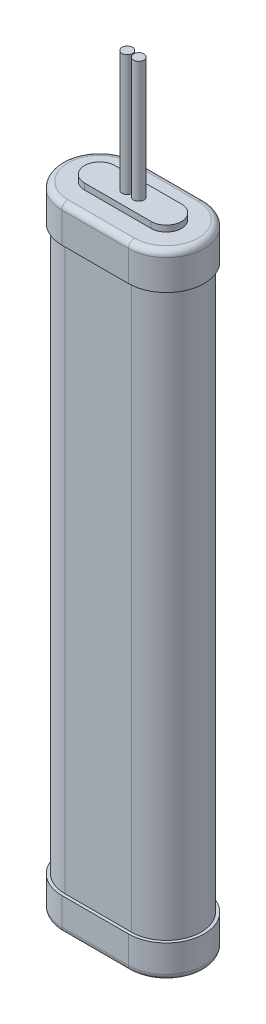
ISO-10303-21;
HEADER;
FILE_DESCRIPTION(('STEP AP214'),'2;1');
FILE_NAME('part.step','',(''),(''),'','','');
FILE_SCHEMA(('AUTOMOTIVE_DESIGN { 1 0 10303 214 1 1 1 1 }'));
ENDSEC;
DATA;
#1=APPLICATION_CONTEXT('core data for automotive mechanical design processes');
#2=APPLICATION_PROTOCOL_DEFINITION('international standard','automotive_design',2000,#1);
#3=PRODUCT_CONTEXT('',#1,'mechanical');
#4=PRODUCT('Part','Part','',(#3));
#5=PRODUCT_RELATED_PRODUCT_CATEGORY('part','',(#4));
#6=PRODUCT_DEFINITION_FORMATION('','',#4);
#7=PRODUCT_DEFINITION_CONTEXT('part definition',#1,'design');
#8=PRODUCT_DEFINITION('design','',#6,#7);
#9=PRODUCT_DEFINITION_SHAPE('','',#8);
#10=(LENGTH_UNIT() NAMED_UNIT(*) SI_UNIT(.MILLI.,.METRE.));
#11=(NAMED_UNIT(*) PLANE_ANGLE_UNIT() SI_UNIT($,.RADIAN.));
#12=(NAMED_UNIT(*) SI_UNIT($,.STERADIAN.) SOLID_ANGLE_UNIT());
#13=UNCERTAINTY_MEASURE_WITH_UNIT(LENGTH_MEASURE(1.E-05),#10,'distance_accuracy_value','');
#14=(GEOMETRIC_REPRESENTATION_CONTEXT(3) GLOBAL_UNCERTAINTY_ASSIGNED_CONTEXT((#13)) GLOBAL_UNIT_ASSIGNED_CONTEXT((#10,
#11,#12)) REPRESENTATION_CONTEXT('',''));
#15=CARTESIAN_POINT('',(0.,0.,0.));
#16=DIRECTION('',(0.,0.,1.));
#17=DIRECTION('',(1.,0.,0.));
#18=AXIS2_PLACEMENT_3D('',#15,#16,#17);
#19=CARTESIAN_POINT('',(0.,211.,-12.5));
#20=DIRECTION('',(0.,1.,0.));
#21=DIRECTION('',(0.,0.,1.));
#22=AXIS2_PLACEMENT_3D('',#19,#20,#21);
#23=PLANE('',#22);
#24=CARTESIAN_POINT('',(9.1,211.,-12.5));
#25=DIRECTION('',(0.,1.,0.));
#26=DIRECTION('',(0.,0.,1.));
#27=AXIS2_PLACEMENT_3D('',#24,#25,#26);
#28=CIRCLE('',#27,1.75);
#29=CARTESIAN_POINT('',(9.1,211.,-10.75));
#30=VERTEX_POINT('',#29);
#31=EDGE_CURVE('E373',#30,#30,#28,.T.);
#32=ORIENTED_EDGE('',*,*,#31,.F.);
#33=EDGE_LOOP('',(#32));
#34=FACE_BOUND('',#33,.T.);
#35=CARTESIAN_POINT('',(0.,211.,-12.5));
#36=DIRECTION('',(0.,1.,0.));
#37=DIRECTION('',(0.,0.,1.));
#38=AXIS2_PLACEMENT_3D('',#35,#36,#37);
#39=CIRCLE('',#38,5.);
#40=CARTESIAN_POINT('',(0.,211.,-17.5));
#41=VERTEX_POINT('',#40);
#42=CARTESIAN_POINT('',(0.,211.,-7.5));
#43=VERTEX_POINT('',#42);
#44=EDGE_CURVE('E178',#41,#43,#39,.T.);
#45=ORIENTED_EDGE('',*,*,#44,.T.);
#46=DIRECTION('',(1.,0.,0.));
#47=VECTOR('',#46,1.);
#48=CARTESIAN_POINT('',(0.,211.,-7.5));
#49=LINE('',#48,#47);
#50=CARTESIAN_POINT('',(22.,211.,-7.5));
#51=VERTEX_POINT('',#50);
#52=EDGE_CURVE('E167',#43,#51,#49,.T.);
#53=ORIENTED_EDGE('',*,*,#52,.T.);
#54=CARTESIAN_POINT('',(22.,211.,-12.5));
#55=DIRECTION('',(0.,1.,0.));
#56=DIRECTION('',(0.,0.,-1.));
#57=AXIS2_PLACEMENT_3D('',#54,#55,#56);
#58=CIRCLE('',#57,5.);
#59=CARTESIAN_POINT('',(22.,211.,-17.5));
#60=VERTEX_POINT('',#59);
#61=EDGE_CURVE('E177',#51,#60,#58,.T.);
#62=ORIENTED_EDGE('',*,*,#61,.T.);
#63=DIRECTION('',(-1.,0.,0.));
#64=VECTOR('',#63,1.);
#65=CARTESIAN_POINT('',(0.,211.,-17.5));
#66=LINE('',#65,#64);
#67=EDGE_CURVE('E183',#60,#41,#66,.T.);
#68=ORIENTED_EDGE('',*,*,#67,.T.);
#69=EDGE_LOOP('',(#45,#53,#62,#68));
#70=FACE_BOUND('',#69,.T.);
#71=CARTESIAN_POINT('',(12.9,211.,-12.5));
#72=DIRECTION('',(0.,1.,0.));
#73=DIRECTION('',(0.,0.,-1.));
#74=AXIS2_PLACEMENT_3D('',#71,#72,#73);
#75=CIRCLE('',#74,1.75);
#76=CARTESIAN_POINT('',(12.9,211.,-14.25));
#77=VERTEX_POINT('',#76);
#78=EDGE_CURVE('E379',#77,#77,#75,.T.);
#79=ORIENTED_EDGE('',*,*,#78,.F.);
#80=EDGE_LOOP('',(#79));
#81=FACE_BOUND('',#80,.T.);
#82=ADVANCED_FACE('F30',(#34,#70,#81),#23,.T.);
#83=CARTESIAN_POINT('',(0.,209.,-12.5));
#84=DIRECTION('',(0.,1.,0.));
#85=DIRECTION('',(0.,0.,1.));
#86=AXIS2_PLACEMENT_3D('',#83,#84,#85);
#87=PLANE('',#86);
#88=DIRECTION('',(1.,0.,0.));
#89=VECTOR('',#88,1.);
#90=CARTESIAN_POINT('',(22.,209.,-2.));
#91=LINE('',#90,#89);
#92=CARTESIAN_POINT('',(0.,209.,-2.));
#93=VERTEX_POINT('',#92);
#94=CARTESIAN_POINT('',(22.,209.,-2.));
#95=VERTEX_POINT('',#94);
#96=EDGE_CURVE('E297',#93,#95,#91,.T.);
#97=ORIENTED_EDGE('',*,*,#96,.T.);
#98=CARTESIAN_POINT('',(22.,209.,-12.5));
#99=DIRECTION('',(0.,1.,0.));
#100=DIRECTION('',(0.,0.,1.));
#101=AXIS2_PLACEMENT_3D('',#98,#99,#100);
#102=CIRCLE('',#101,10.5);
#103=CARTESIAN_POINT('',(22.,209.,-23.));
#104=VERTEX_POINT('',#103);
#105=EDGE_CURVE('E299',#95,#104,#102,.T.);
#106=ORIENTED_EDGE('',*,*,#105,.T.);
#107=DIRECTION('',(-1.,0.,0.));
#108=VECTOR('',#107,1.);
#109=CARTESIAN_POINT('',(0.,209.,-23.));
#110=LINE('',#109,#108);
#111=CARTESIAN_POINT('',(0.,209.,-23.));
#112=VERTEX_POINT('',#111);
#113=EDGE_CURVE('E295',#104,#112,#110,.T.);
#114=ORIENTED_EDGE('',*,*,#113,.T.);
#115=CARTESIAN_POINT('',(0.,209.,-12.5));
#116=DIRECTION('',(0.,1.,0.));
#117=DIRECTION('',(0.,0.,1.));
#118=AXIS2_PLACEMENT_3D('',#115,#116,#117);
#119=CIRCLE('',#118,10.5);
#120=EDGE_CURVE('E293',#112,#93,#119,.T.);
#121=ORIENTED_EDGE('',*,*,#120,.T.);
#122=EDGE_LOOP('',(#97,#106,#114,#121));
#123=FACE_BOUND('',#122,.T.);
#124=DIRECTION('',(1.,0.,0.));
#125=VECTOR('',#124,1.);
#126=CARTESIAN_POINT('',(0.,209.,-7.5));
#127=LINE('',#126,#125);
#128=CARTESIAN_POINT('',(0.,209.,-7.5));
#129=VERTEX_POINT('',#128);
#130=CARTESIAN_POINT('',(22.,209.,-7.5));
#131=VERTEX_POINT('',#130);
#132=EDGE_CURVE('E355',#129,#131,#127,.T.);
#133=ORIENTED_EDGE('',*,*,#132,.F.);
#134=CARTESIAN_POINT('',(0.,209.,-12.5));
#135=DIRECTION('',(0.,1.,0.));
#136=DIRECTION('',(0.,0.,1.));
#137=AXIS2_PLACEMENT_3D('',#134,#135,#136);
#138=CIRCLE('',#137,5.);
#139=CARTESIAN_POINT('',(0.,209.,-17.5));
#140=VERTEX_POINT('',#139);
#141=EDGE_CURVE('E191',#140,#129,#138,.T.);
#142=ORIENTED_EDGE('',*,*,#141,.F.);
#143=DIRECTION('',(-1.,0.,0.));
#144=VECTOR('',#143,1.);
#145=CARTESIAN_POINT('',(0.,209.,-17.5));
#146=LINE('',#145,#144);
#147=CARTESIAN_POINT('',(22.,209.,-17.5));
#148=VERTEX_POINT('',#147);
#149=EDGE_CURVE('E187',#148,#140,#146,.T.);
#150=ORIENTED_EDGE('',*,*,#149,.F.);
#151=CARTESIAN_POINT('',(22.,209.,-12.5));
#152=DIRECTION('',(0.,1.,0.));
#153=DIRECTION('',(0.,0.,-1.));
#154=AXIS2_PLACEMENT_3D('',#151,#152,#153);
#155=CIRCLE('',#154,5.);
#156=EDGE_CURVE('E358',#131,#148,#155,.T.);
#157=ORIENTED_EDGE('',*,*,#156,.F.);
#158=EDGE_LOOP('',(#133,#142,#150,#157));
#159=FACE_BOUND('',#158,.T.);
#160=ADVANCED_FACE('F349',(#123,#159),#87,.T.);
#161=CARTESIAN_POINT('',(0.,11.,-12.5));
#162=DIRECTION('',(0.,-1.,0.));
#163=DIRECTION('',(0.,0.,-1.));
#164=AXIS2_PLACEMENT_3D('',#161,#162,#163);
#165=PLANE('',#164);
#166=CARTESIAN_POINT('',(0.,11.,-12.5));
#167=DIRECTION('',(0.,1.,0.));
#168=DIRECTION('',(0.,0.,-1.));
#169=AXIS2_PLACEMENT_3D('',#166,#167,#168);
#170=CIRCLE('',#169,12.5);
#171=CARTESIAN_POINT('',(0.,11.,-25.));
#172=VERTEX_POINT('',#171);
#173=CARTESIAN_POINT('',(0.,11.,0.));
#174=VERTEX_POINT('',#173);
#175=EDGE_CURVE('E254',#172,#174,#170,.T.);
#176=ORIENTED_EDGE('',*,*,#175,.T.);
#177=DIRECTION('',(1.,0.,0.));
#178=VECTOR('',#177,1.);
#179=CARTESIAN_POINT('',(0.,11.,0.));
#180=LINE('',#179,#178);
#181=CARTESIAN_POINT('',(22.,11.,0.));
#182=VERTEX_POINT('',#181);
#183=EDGE_CURVE('E257',#174,#182,#180,.T.);
#184=ORIENTED_EDGE('',*,*,#183,.T.);
#185=CARTESIAN_POINT('',(22.,11.,-12.5));
#186=DIRECTION('',(0.,1.,0.));
#187=DIRECTION('',(0.,0.,1.));
#188=AXIS2_PLACEMENT_3D('',#185,#186,#187);
#189=CIRCLE('',#188,12.5);
#190=CARTESIAN_POINT('',(22.,11.,-25.));
#191=VERTEX_POINT('',#190);
#192=EDGE_CURVE('E259',#182,#191,#189,.T.);
#193=ORIENTED_EDGE('',*,*,#192,.T.);
#194=DIRECTION('',(-1.,0.,0.));
#195=VECTOR('',#194,1.);
#196=CARTESIAN_POINT('',(0.,11.,-25.));
#197=LINE('',#196,#195);
#198=EDGE_CURVE('E261',#191,#172,#197,.T.);
#199=ORIENTED_EDGE('',*,*,#198,.T.);
#200=EDGE_LOOP('',(#176,#184,#193,#199));
#201=FACE_BOUND('',#200,.T.);
#202=CARTESIAN_POINT('',(0.,11.,-12.5));
#203=DIRECTION('',(0.,1.,0.));
#204=DIRECTION('',(0.,0.,-1.));
#205=AXIS2_PLACEMENT_3D('',#202,#203,#204);
#206=CIRCLE('',#205,11.5);
#207=CARTESIAN_POINT('',(0.,11.,-24.));
#208=VERTEX_POINT('',#207);
#209=CARTESIAN_POINT('',(0.,11.,-1.));
#210=VERTEX_POINT('',#209);
#211=EDGE_CURVE('E218',#208,#210,#206,.T.);
#212=ORIENTED_EDGE('',*,*,#211,.F.);
#213=DIRECTION('',(-1.,0.,0.));
#214=VECTOR('',#213,1.);
#215=CARTESIAN_POINT('',(0.,11.,-24.));
#216=LINE('',#215,#214);
#217=CARTESIAN_POINT('',(22.,11.,-24.));
#218=VERTEX_POINT('',#217);
#219=EDGE_CURVE('E223',#218,#208,#216,.T.);
#220=ORIENTED_EDGE('',*,*,#219,.F.);
#221=CARTESIAN_POINT('',(22.,11.,-12.5));
#222=DIRECTION('',(0.,1.,0.));
#223=DIRECTION('',(0.,0.,1.));
#224=AXIS2_PLACEMENT_3D('',#221,#222,#223);
#225=CIRCLE('',#224,11.5);
#226=CARTESIAN_POINT('',(22.,11.,-1.));
#227=VERTEX_POINT('',#226);
#228=EDGE_CURVE('E238',#227,#218,#225,.T.);
#229=ORIENTED_EDGE('',*,*,#228,.F.);
#230=DIRECTION('',(1.,0.,0.));
#231=VECTOR('',#230,1.);
#232=CARTESIAN_POINT('',(0.,11.,-1.));
#233=LINE('',#232,#231);
#234=EDGE_CURVE('E235',#210,#227,#233,.T.);
#235=ORIENTED_EDGE('',*,*,#234,.F.);
#236=EDGE_LOOP('',(#212,#220,#229,#235));
#237=FACE_BOUND('',#236,.T.);
#238=ADVANCED_FACE('F352',(#201,#237),#165,.F.);
#239=CARTESIAN_POINT('',(0.,11.,-12.5));
#240=DIRECTION('',(0.,-1.,0.));
#241=DIRECTION('',(0.,0.,-1.));
#242=AXIS2_PLACEMENT_3D('',#239,#240,#241);
#243=CYLINDRICAL_SURFACE('',#242,12.5);
#244=DIRECTION('',(0.,-1.,0.));
#245=VECTOR('',#244,1.);
#246=CARTESIAN_POINT('',(0.,11.,-25.));
#247=LINE('',#246,#245);
#248=CARTESIAN_POINT('',(0.,2.,-25.));
#249=VERTEX_POINT('',#248);
#250=EDGE_CURVE('E263',#172,#249,#247,.T.);
#251=ORIENTED_EDGE('',*,*,#250,.T.);
#252=CARTESIAN_POINT('',(0.,2.,-12.5));
#253=DIRECTION('',(0.,-1.,0.));
#254=DIRECTION('',(0.,0.,-1.));
#255=AXIS2_PLACEMENT_3D('',#252,#253,#254);
#256=CIRCLE('',#255,12.5);
#257=CARTESIAN_POINT('',(0.,2.,0.));
#258=VERTEX_POINT('',#257);
#259=EDGE_CURVE('E291',#249,#258,#256,.F.);
#260=ORIENTED_EDGE('',*,*,#259,.T.);
#261=DIRECTION('',(0.,-1.,0.));
#262=VECTOR('',#261,1.);
#263=CARTESIAN_POINT('',(0.,11.,0.));
#264=LINE('',#263,#262);
#265=EDGE_CURVE('E272',#174,#258,#264,.T.);
#266=ORIENTED_EDGE('',*,*,#265,.F.);
#267=ORIENTED_EDGE('',*,*,#175,.F.);
#268=EDGE_LOOP('',(#251,#260,#266,#267));
#269=FACE_BOUND('',#268,.T.);
#270=ADVANCED_FACE('F445',(#269),#243,.T.);
#271=CARTESIAN_POINT('',(0.,11.,0.));
#272=DIRECTION('',(0.,0.,-1.));
#273=DIRECTION('',(-1.,0.,0.));
#274=AXIS2_PLACEMENT_3D('',#271,#272,#273);
#275=PLANE('',#274);
#276=ORIENTED_EDGE('',*,*,#265,.T.);
#277=DIRECTION('',(1.,0.,0.));
#278=VECTOR('',#277,1.);
#279=CARTESIAN_POINT('',(22.,2.,0.));
#280=LINE('',#279,#278);
#281=CARTESIAN_POINT('',(22.,2.,0.));
#282=VERTEX_POINT('',#281);
#283=EDGE_CURVE('E275',#258,#282,#280,.T.);
#284=ORIENTED_EDGE('',*,*,#283,.T.);
#285=DIRECTION('',(0.,-1.,0.));
#286=VECTOR('',#285,1.);
#287=CARTESIAN_POINT('',(22.,11.,0.));
#288=LINE('',#287,#286);
#289=EDGE_CURVE('E269',#182,#282,#288,.T.);
#290=ORIENTED_EDGE('',*,*,#289,.F.);
#291=ORIENTED_EDGE('',*,*,#183,.F.);
#292=EDGE_LOOP('',(#276,#284,#290,#291));
#293=FACE_BOUND('',#292,.T.);
#294=ADVANCED_FACE('F457',(#293),#275,.F.);
#295=CARTESIAN_POINT('',(22.,11.,-12.5));
#296=DIRECTION('',(0.,-1.,0.));
#297=DIRECTION('',(0.,0.,-1.));
#298=AXIS2_PLACEMENT_3D('',#295,#296,#297);
#299=CYLINDRICAL_SURFACE('',#298,12.5);
#300=ORIENTED_EDGE('',*,*,#289,.T.);
#301=CARTESIAN_POINT('',(22.,2.,-12.5));
#302=DIRECTION('',(0.,-1.,0.));
#303=DIRECTION('',(0.,0.,-1.));
#304=AXIS2_PLACEMENT_3D('',#301,#302,#303);
#305=CIRCLE('',#304,12.5);
#306=CARTESIAN_POINT('',(22.,2.,-25.));
#307=VERTEX_POINT('',#306);
#308=EDGE_CURVE('E287',#282,#307,#305,.F.);
#309=ORIENTED_EDGE('',*,*,#308,.T.);
#310=DIRECTION('',(0.,-1.,0.));
#311=VECTOR('',#310,1.);
#312=CARTESIAN_POINT('',(22.,11.,-25.));
#313=LINE('',#312,#311);
#314=EDGE_CURVE('E266',#191,#307,#313,.T.);
#315=ORIENTED_EDGE('',*,*,#314,.F.);
#316=ORIENTED_EDGE('',*,*,#192,.F.);
#317=EDGE_LOOP('',(#300,#309,#315,#316));
#318=FACE_BOUND('',#317,.T.);
#319=ADVANCED_FACE('F453',(#318),#299,.T.);
#320=CARTESIAN_POINT('',(0.,11.,-25.));
#321=DIRECTION('',(0.,0.,1.));
#322=DIRECTION('',(1.,0.,0.));
#323=AXIS2_PLACEMENT_3D('',#320,#321,#322);
#324=PLANE('',#323);
#325=ORIENTED_EDGE('',*,*,#314,.T.);
#326=DIRECTION('',(-1.,0.,0.));
#327=VECTOR('',#326,1.);
#328=CARTESIAN_POINT('',(0.,2.,-25.));
#329=LINE('',#328,#327);
#330=EDGE_CURVE('E289',#307,#249,#329,.T.);
#331=ORIENTED_EDGE('',*,*,#330,.T.);
#332=ORIENTED_EDGE('',*,*,#250,.F.);
#333=ORIENTED_EDGE('',*,*,#198,.F.);
#334=EDGE_LOOP('',(#325,#331,#332,#333));
#335=FACE_BOUND('',#334,.T.);
#336=ADVANCED_FACE('F449',(#335),#324,.F.);
#337=CARTESIAN_POINT('',(0.,0.,-12.5));
#338=DIRECTION('',(0.,-1.,0.));
#339=DIRECTION('',(0.,0.,-1.));
#340=AXIS2_PLACEMENT_3D('',#337,#338,#339);
#341=PLANE('',#340);
#342=CARTESIAN_POINT('',(22.,0.,-12.5));
#343=DIRECTION('',(0.,-1.,0.));
#344=DIRECTION('',(0.,0.,-1.));
#345=AXIS2_PLACEMENT_3D('',#342,#343,#344);
#346=CIRCLE('',#345,10.5);
#347=CARTESIAN_POINT('',(22.,0.,-23.));
#348=VERTEX_POINT('',#347);
#349=CARTESIAN_POINT('',(22.,0.,-2.));
#350=VERTEX_POINT('',#349);
#351=EDGE_CURVE('E282',#348,#350,#346,.T.);
#352=ORIENTED_EDGE('',*,*,#351,.T.);
#353=DIRECTION('',(1.,0.,0.));
#354=VECTOR('',#353,1.);
#355=CARTESIAN_POINT('',(0.,0.,-2.));
#356=LINE('',#355,#354);
#357=CARTESIAN_POINT('',(0.,0.,-2.));
#358=VERTEX_POINT('',#357);
#359=EDGE_CURVE('E284',#350,#358,#356,.F.);
#360=ORIENTED_EDGE('',*,*,#359,.T.);
#361=CARTESIAN_POINT('',(0.,0.,-12.5));
#362=DIRECTION('',(0.,-1.,0.));
#363=DIRECTION('',(0.,0.,-1.));
#364=AXIS2_PLACEMENT_3D('',#361,#362,#363);
#365=CIRCLE('',#364,10.5);
#366=CARTESIAN_POINT('',(0.,0.,-23.));
#367=VERTEX_POINT('',#366);
#368=EDGE_CURVE('E278',#358,#367,#365,.T.);
#369=ORIENTED_EDGE('',*,*,#368,.T.);
#370=DIRECTION('',(-1.,0.,0.));
#371=VECTOR('',#370,1.);
#372=CARTESIAN_POINT('',(22.,0.,-23.));
#373=LINE('',#372,#371);
#374=EDGE_CURVE('E280',#367,#348,#373,.F.);
#375=ORIENTED_EDGE('',*,*,#374,.T.);
#376=EDGE_LOOP('',(#352,#360,#369,#375));
#377=FACE_BOUND('',#376,.T.);
#378=ADVANCED_FACE('F441',(#377),#341,.T.);
#379=CARTESIAN_POINT('',(0.,197.,-12.5));
#380=DIRECTION('',(0.,-1.,0.));
#381=DIRECTION('',(0.,0.,-1.));
#382=AXIS2_PLACEMENT_3D('',#379,#380,#381);
#383=CYLINDRICAL_SURFACE('',#382,11.5);
#384=ORIENTED_EDGE('',*,*,#211,.T.);
#385=DIRECTION('',(0.,-1.,0.));
#386=VECTOR('',#385,1.);
#387=CARTESIAN_POINT('',(0.,197.,-1.));
#388=LINE('',#387,#386);
#389=CARTESIAN_POINT('',(0.,197.,-1.));
#390=VERTEX_POINT('',#389);
#391=EDGE_CURVE('E251',#390,#210,#388,.T.);
#392=ORIENTED_EDGE('',*,*,#391,.F.);
#393=CARTESIAN_POINT('',(0.,197.,-12.5));
#394=DIRECTION('',(0.,1.,0.));
#395=DIRECTION('',(0.,0.,-1.));
#396=AXIS2_PLACEMENT_3D('',#393,#394,#395);
#397=CIRCLE('',#396,11.5);
#398=CARTESIAN_POINT('',(0.,197.,-24.));
#399=VERTEX_POINT('',#398);
#400=EDGE_CURVE('E219',#399,#390,#397,.T.);
#401=ORIENTED_EDGE('',*,*,#400,.F.);
#402=DIRECTION('',(0.,-1.,0.));
#403=VECTOR('',#402,1.);
#404=CARTESIAN_POINT('',(0.,197.,-24.));
#405=LINE('',#404,#403);
#406=EDGE_CURVE('E232',#399,#208,#405,.T.);
#407=ORIENTED_EDGE('',*,*,#406,.T.);
#408=EDGE_LOOP('',(#384,#392,#401,#407));
#409=FACE_BOUND('',#408,.T.);
#410=ADVANCED_FACE('F437',(#409),#383,.T.);
#411=CARTESIAN_POINT('',(0.,197.,-1.));
#412=DIRECTION('',(0.,0.,-1.));
#413=DIRECTION('',(-1.,0.,0.));
#414=AXIS2_PLACEMENT_3D('',#411,#412,#413);
#415=PLANE('',#414);
#416=ORIENTED_EDGE('',*,*,#234,.T.);
#417=DIRECTION('',(0.,-1.,0.));
#418=VECTOR('',#417,1.);
#419=CARTESIAN_POINT('',(22.,197.,-1.));
#420=LINE('',#419,#418);
#421=CARTESIAN_POINT('',(22.,197.,-1.));
#422=VERTEX_POINT('',#421);
#423=EDGE_CURVE('E248',#422,#227,#420,.T.);
#424=ORIENTED_EDGE('',*,*,#423,.F.);
#425=DIRECTION('',(1.,0.,0.));
#426=VECTOR('',#425,1.);
#427=CARTESIAN_POINT('',(0.,197.,-1.));
#428=LINE('',#427,#426);
#429=EDGE_CURVE('E222',#390,#422,#428,.T.);
#430=ORIENTED_EDGE('',*,*,#429,.F.);
#431=ORIENTED_EDGE('',*,*,#391,.T.);
#432=EDGE_LOOP('',(#416,#424,#430,#431));
#433=FACE_BOUND('',#432,.T.);
#434=ADVANCED_FACE('F433',(#433),#415,.F.);
#435=CARTESIAN_POINT('',(22.,197.,-12.5));
#436=DIRECTION('',(0.,-1.,0.));
#437=DIRECTION('',(0.,0.,-1.));
#438=AXIS2_PLACEMENT_3D('',#435,#436,#437);
#439=CYLINDRICAL_SURFACE('',#438,11.5);
#440=ORIENTED_EDGE('',*,*,#228,.T.);
#441=DIRECTION('',(0.,-1.,0.));
#442=VECTOR('',#441,1.);
#443=CARTESIAN_POINT('',(22.,197.,-24.));
#444=LINE('',#443,#442);
#445=CARTESIAN_POINT('',(22.,197.,-24.));
#446=VERTEX_POINT('',#445);
#447=EDGE_CURVE('E245',#446,#218,#444,.T.);
#448=ORIENTED_EDGE('',*,*,#447,.F.);
#449=CARTESIAN_POINT('',(22.,197.,-12.5));
#450=DIRECTION('',(0.,1.,0.));
#451=DIRECTION('',(0.,0.,1.));
#452=AXIS2_PLACEMENT_3D('',#449,#450,#451);
#453=CIRCLE('',#452,11.5);
#454=EDGE_CURVE('E226',#422,#446,#453,.T.);
#455=ORIENTED_EDGE('',*,*,#454,.F.);
#456=ORIENTED_EDGE('',*,*,#423,.T.);
#457=EDGE_LOOP('',(#440,#448,#455,#456));
#458=FACE_BOUND('',#457,.T.);
#459=ADVANCED_FACE('F429',(#458),#439,.T.);
#460=CARTESIAN_POINT('',(0.,197.,-24.));
#461=DIRECTION('',(0.,0.,1.));
#462=DIRECTION('',(1.,0.,0.));
#463=AXIS2_PLACEMENT_3D('',#460,#461,#462);
#464=PLANE('',#463);
#465=ORIENTED_EDGE('',*,*,#219,.T.);
#466=ORIENTED_EDGE('',*,*,#406,.F.);
#467=DIRECTION('',(-1.,0.,0.));
#468=VECTOR('',#467,1.);
#469=CARTESIAN_POINT('',(0.,197.,-24.));
#470=LINE('',#469,#468);
#471=EDGE_CURVE('E229',#446,#399,#470,.T.);
#472=ORIENTED_EDGE('',*,*,#471,.F.);
#473=ORIENTED_EDGE('',*,*,#447,.T.);
#474=EDGE_LOOP('',(#465,#466,#472,#473));
#475=FACE_BOUND('',#474,.T.);
#476=ADVANCED_FACE('F416',(#475),#464,.F.);
#477=CARTESIAN_POINT('',(0.,197.,-12.5));
#478=DIRECTION('',(0.,1.,0.));
#479=DIRECTION('',(0.,0.,1.));
#480=AXIS2_PLACEMENT_3D('',#477,#478,#479);
#481=PLANE('',#480);
#482=CARTESIAN_POINT('',(0.,197.,-12.5));
#483=DIRECTION('',(0.,1.,0.));
#484=DIRECTION('',(0.,0.,1.));
#485=AXIS2_PLACEMENT_3D('',#482,#483,#484);
#486=CIRCLE('',#485,12.5);
#487=CARTESIAN_POINT('',(0.,197.,-25.));
#488=VERTEX_POINT('',#487);
#489=CARTESIAN_POINT('',(0.,197.,0.));
#490=VERTEX_POINT('',#489);
#491=EDGE_CURVE('E193',#488,#490,#486,.T.);
#492=ORIENTED_EDGE('',*,*,#491,.F.);
#493=DIRECTION('',(-1.,0.,0.));
#494=VECTOR('',#493,1.);
#495=CARTESIAN_POINT('',(0.,197.,-25.));
#496=LINE('',#495,#494);
#497=CARTESIAN_POINT('',(22.,197.,-25.));
#498=VERTEX_POINT('',#497);
#499=EDGE_CURVE('E207',#498,#488,#496,.T.);
#500=ORIENTED_EDGE('',*,*,#499,.F.);
#501=CARTESIAN_POINT('',(22.,197.,-12.5));
#502=DIRECTION('',(0.,1.,0.));
#503=DIRECTION('',(0.,0.,-1.));
#504=AXIS2_PLACEMENT_3D('',#501,#502,#503);
#505=CIRCLE('',#504,12.5);
#506=CARTESIAN_POINT('',(22.,197.,0.));
#507=VERTEX_POINT('',#506);
#508=EDGE_CURVE('E204',#507,#498,#505,.T.);
#509=ORIENTED_EDGE('',*,*,#508,.F.);
#510=DIRECTION('',(1.,0.,0.));
#511=VECTOR('',#510,1.);
#512=CARTESIAN_POINT('',(0.,197.,0.));
#513=LINE('',#512,#511);
#514=EDGE_CURVE('E196',#490,#507,#513,.T.);
#515=ORIENTED_EDGE('',*,*,#514,.F.);
#516=EDGE_LOOP('',(#492,#500,#509,#515));
#517=FACE_BOUND('',#516,.T.);
#518=ORIENTED_EDGE('',*,*,#471,.T.);
#519=ORIENTED_EDGE('',*,*,#400,.T.);
#520=ORIENTED_EDGE('',*,*,#429,.T.);
#521=ORIENTED_EDGE('',*,*,#454,.T.);
#522=EDGE_LOOP('',(#518,#519,#520,#521));
#523=FACE_BOUND('',#522,.T.);
#524=ADVANCED_FACE('F412',(#517,#523),#481,.F.);
#525=CARTESIAN_POINT('',(0.,209.,-12.5));
#526=DIRECTION('',(0.,-1.,0.));
#527=DIRECTION('',(0.,0.,-1.));
#528=AXIS2_PLACEMENT_3D('',#525,#526,#527);
#529=CYLINDRICAL_SURFACE('',#528,12.5);
#530=DIRECTION('',(0.,-1.,0.));
#531=VECTOR('',#530,1.);
#532=CARTESIAN_POINT('',(0.,209.,0.));
#533=LINE('',#532,#531);
#534=CARTESIAN_POINT('',(0.,207.,0.));
#535=VERTEX_POINT('',#534);
#536=EDGE_CURVE('E216',#535,#490,#533,.T.);
#537=ORIENTED_EDGE('',*,*,#536,.F.);
#538=CARTESIAN_POINT('',(0.,207.,-12.5));
#539=DIRECTION('',(0.,1.,0.));
#540=DIRECTION('',(0.,0.,1.));
#541=AXIS2_PLACEMENT_3D('',#538,#539,#540);
#542=CIRCLE('',#541,12.5);
#543=CARTESIAN_POINT('',(0.,207.,-25.));
#544=VERTEX_POINT('',#543);
#545=EDGE_CURVE('E11',#535,#544,#542,.F.);
#546=ORIENTED_EDGE('',*,*,#545,.T.);
#547=DIRECTION('',(0.,-1.,0.));
#548=VECTOR('',#547,1.);
#549=CARTESIAN_POINT('',(0.,209.,-25.));
#550=LINE('',#549,#548);
#551=EDGE_CURVE('E210',#544,#488,#550,.T.);
#552=ORIENTED_EDGE('',*,*,#551,.T.);
#553=ORIENTED_EDGE('',*,*,#491,.T.);
#554=EDGE_LOOP('',(#537,#546,#552,#553));
#555=FACE_BOUND('',#554,.T.);
#556=ADVANCED_FACE('F415',(#555),#529,.T.);
#557=CARTESIAN_POINT('',(0.,209.,0.));
#558=DIRECTION('',(0.,0.,-1.));
#559=DIRECTION('',(-1.,0.,0.));
#560=AXIS2_PLACEMENT_3D('',#557,#558,#559);
#561=PLANE('',#560);
#562=DIRECTION('',(0.,-1.,0.));
#563=VECTOR('',#562,1.);
#564=CARTESIAN_POINT('',(22.,209.,0.));
#565=LINE('',#564,#563);
#566=CARTESIAN_POINT('',(22.,207.,0.));
#567=VERTEX_POINT('',#566);
#568=EDGE_CURVE('E214',#567,#507,#565,.T.);
#569=ORIENTED_EDGE('',*,*,#568,.F.);
#570=DIRECTION('',(1.,0.,0.));
#571=VECTOR('',#570,1.);
#572=CARTESIAN_POINT('',(0.,207.,0.));
#573=LINE('',#572,#571);
#574=EDGE_CURVE('E53',#567,#535,#573,.F.);
#575=ORIENTED_EDGE('',*,*,#574,.T.);
#576=ORIENTED_EDGE('',*,*,#536,.T.);
#577=ORIENTED_EDGE('',*,*,#514,.T.);
#578=EDGE_LOOP('',(#569,#575,#576,#577));
#579=FACE_BOUND('',#578,.T.);
#580=ADVANCED_FACE('F422',(#579),#561,.F.);
#581=CARTESIAN_POINT('',(22.,209.,-12.5));
#582=DIRECTION('',(0.,-1.,0.));
#583=DIRECTION('',(0.,0.,-1.));
#584=AXIS2_PLACEMENT_3D('',#581,#582,#583);
#585=CYLINDRICAL_SURFACE('',#584,12.5);
#586=DIRECTION('',(0.,-1.,0.));
#587=VECTOR('',#586,1.);
#588=CARTESIAN_POINT('',(22.,209.,-25.));
#589=LINE('',#588,#587);
#590=CARTESIAN_POINT('',(22.,207.,-25.));
#591=VERTEX_POINT('',#590);
#592=EDGE_CURVE('E212',#591,#498,#589,.T.);
#593=ORIENTED_EDGE('',*,*,#592,.F.);
#594=CARTESIAN_POINT('',(22.,207.,-12.5));
#595=DIRECTION('',(0.,1.,0.));
#596=DIRECTION('',(0.,0.,1.));
#597=AXIS2_PLACEMENT_3D('',#594,#595,#596);
#598=CIRCLE('',#597,12.5);
#599=EDGE_CURVE('E302',#591,#567,#598,.F.);
#600=ORIENTED_EDGE('',*,*,#599,.T.);
#601=ORIENTED_EDGE('',*,*,#568,.T.);
#602=ORIENTED_EDGE('',*,*,#508,.T.);
#603=EDGE_LOOP('',(#593,#600,#601,#602));
#604=FACE_BOUND('',#603,.T.);
#605=ADVANCED_FACE('F342',(#604),#585,.T.);
#606=CARTESIAN_POINT('',(0.,209.,-25.));
#607=DIRECTION('',(0.,0.,1.));
#608=DIRECTION('',(1.,0.,0.));
#609=AXIS2_PLACEMENT_3D('',#606,#607,#608);
#610=PLANE('',#609);
#611=ORIENTED_EDGE('',*,*,#551,.F.);
#612=DIRECTION('',(-1.,0.,0.));
#613=VECTOR('',#612,1.);
#614=CARTESIAN_POINT('',(22.,207.,-25.));
#615=LINE('',#614,#613);
#616=EDGE_CURVE('E39',#544,#591,#615,.F.);
#617=ORIENTED_EDGE('',*,*,#616,.T.);
#618=ORIENTED_EDGE('',*,*,#592,.T.);
#619=ORIENTED_EDGE('',*,*,#499,.T.);
#620=EDGE_LOOP('',(#611,#617,#618,#619));
#621=FACE_BOUND('',#620,.T.);
#622=ADVANCED_FACE('F339',(#621),#610,.F.);
#623=CARTESIAN_POINT('',(0.,211.,-12.5));
#624=DIRECTION('',(0.,-1.,0.));
#625=DIRECTION('',(0.,0.,-1.));
#626=AXIS2_PLACEMENT_3D('',#623,#624,#625);
#627=CYLINDRICAL_SURFACE('',#626,5.);
#628=ORIENTED_EDGE('',*,*,#141,.T.);
#629=DIRECTION('',(0.,-1.,0.));
#630=VECTOR('',#629,1.);
#631=CARTESIAN_POINT('',(0.,211.,-7.5));
#632=LINE('',#631,#630);
#633=EDGE_CURVE('E171',#43,#129,#632,.T.);
#634=ORIENTED_EDGE('',*,*,#633,.F.);
#635=ORIENTED_EDGE('',*,*,#44,.F.);
#636=DIRECTION('',(0.,-1.,0.));
#637=VECTOR('',#636,1.);
#638=CARTESIAN_POINT('',(0.,211.,-17.5));
#639=LINE('',#638,#637);
#640=EDGE_CURVE('E365',#41,#140,#639,.T.);
#641=ORIENTED_EDGE('',*,*,#640,.T.);
#642=EDGE_LOOP('',(#628,#634,#635,#641));
#643=FACE_BOUND('',#642,.T.);
#644=ADVANCED_FACE('F189',(#643),#627,.T.);
#645=CARTESIAN_POINT('',(0.,211.,-7.5));
#646=DIRECTION('',(0.,0.,-1.));
#647=DIRECTION('',(-1.,0.,0.));
#648=AXIS2_PLACEMENT_3D('',#645,#646,#647);
#649=PLANE('',#648);
#650=ORIENTED_EDGE('',*,*,#132,.T.);
#651=DIRECTION('',(0.,-1.,0.));
#652=VECTOR('',#651,1.);
#653=CARTESIAN_POINT('',(22.,211.,-7.5));
#654=LINE('',#653,#652);
#655=EDGE_CURVE('E174',#51,#131,#654,.T.);
#656=ORIENTED_EDGE('',*,*,#655,.F.);
#657=ORIENTED_EDGE('',*,*,#52,.F.);
#658=ORIENTED_EDGE('',*,*,#633,.T.);
#659=EDGE_LOOP('',(#650,#656,#657,#658));
#660=FACE_BOUND('',#659,.T.);
#661=ADVANCED_FACE('F169',(#660),#649,.F.);
#662=CARTESIAN_POINT('',(22.,211.,-12.5));
#663=DIRECTION('',(0.,-1.,0.));
#664=DIRECTION('',(0.,0.,-1.));
#665=AXIS2_PLACEMENT_3D('',#662,#663,#664);
#666=CYLINDRICAL_SURFACE('',#665,5.);
#667=ORIENTED_EDGE('',*,*,#156,.T.);
#668=DIRECTION('',(0.,-1.,0.));
#669=VECTOR('',#668,1.);
#670=CARTESIAN_POINT('',(22.,211.,-17.5));
#671=LINE('',#670,#669);
#672=EDGE_CURVE('E198',#60,#148,#671,.T.);
#673=ORIENTED_EDGE('',*,*,#672,.F.);
#674=ORIENTED_EDGE('',*,*,#61,.F.);
#675=ORIENTED_EDGE('',*,*,#655,.T.);
#676=EDGE_LOOP('',(#667,#673,#674,#675));
#677=FACE_BOUND('',#676,.T.);
#678=ADVANCED_FACE('F370',(#677),#666,.T.);
#679=CARTESIAN_POINT('',(0.,211.,-17.5));
#680=DIRECTION('',(0.,0.,1.));
#681=DIRECTION('',(1.,0.,0.));
#682=AXIS2_PLACEMENT_3D('',#679,#680,#681);
#683=PLANE('',#682);
#684=ORIENTED_EDGE('',*,*,#149,.T.);
#685=ORIENTED_EDGE('',*,*,#640,.F.);
#686=ORIENTED_EDGE('',*,*,#67,.F.);
#687=ORIENTED_EDGE('',*,*,#672,.T.);
#688=EDGE_LOOP('',(#684,#685,#686,#687));
#689=FACE_BOUND('',#688,.T.);
#690=ADVANCED_FACE('F368',(#689),#683,.F.);
#691=CARTESIAN_POINT('',(0.,2.,-23.));
#692=DIRECTION('',(1.,0.,0.));
#693=DIRECTION('',(0.,0.,-1.));
#694=AXIS2_PLACEMENT_3D('',#691,#692,#693);
#695=CYLINDRICAL_SURFACE('',#694,2.);
#696=CARTESIAN_POINT('',(22.,2.,-23.));
#697=DIRECTION('',(1.,0.,0.));
#698=DIRECTION('',(0.,0.,-1.));
#699=AXIS2_PLACEMENT_3D('',#696,#697,#698);
#700=CIRCLE('',#699,2.);
#701=EDGE_CURVE('E311',#348,#307,#700,.T.);
#702=ORIENTED_EDGE('',*,*,#701,.F.);
#703=ORIENTED_EDGE('',*,*,#374,.F.);
#704=CARTESIAN_POINT('',(0.,2.,-23.));
#705=DIRECTION('',(-1.,0.,0.));
#706=DIRECTION('',(0.,0.,1.));
#707=AXIS2_PLACEMENT_3D('',#704,#705,#706);
#708=CIRCLE('',#707,2.);
#709=EDGE_CURVE('E314',#249,#367,#708,.T.);
#710=ORIENTED_EDGE('',*,*,#709,.F.);
#711=ORIENTED_EDGE('',*,*,#330,.F.);
#712=EDGE_LOOP('',(#702,#703,#710,#711));
#713=FACE_BOUND('',#712,.T.);
#714=ADVANCED_FACE('F405',(#713),#695,.T.);
#715=CARTESIAN_POINT('',(0.,2.,-12.5));
#716=DIRECTION('',(0.,-1.,0.));
#717=DIRECTION('',(0.,0.,-1.));
#718=AXIS2_PLACEMENT_3D('',#715,#716,#717);
#719=TOROIDAL_SURFACE('',#718,10.5,2.);
#720=ORIENTED_EDGE('',*,*,#709,.T.);
#721=ORIENTED_EDGE('',*,*,#368,.F.);
#722=CARTESIAN_POINT('',(0.,2.,-2.));
#723=DIRECTION('',(1.,0.,0.));
#724=DIRECTION('',(0.,0.,-1.));
#725=AXIS2_PLACEMENT_3D('',#722,#723,#724);
#726=CIRCLE('',#725,2.);
#727=EDGE_CURVE('E309',#258,#358,#726,.T.);
#728=ORIENTED_EDGE('',*,*,#727,.F.);
#729=ORIENTED_EDGE('',*,*,#259,.F.);
#730=EDGE_LOOP('',(#720,#721,#728,#729));
#731=FACE_BOUND('',#730,.T.);
#732=ADVANCED_FACE('F472',(#731),#719,.T.);
#733=CARTESIAN_POINT('',(22.,2.,-12.5));
#734=DIRECTION('',(0.,-1.,0.));
#735=DIRECTION('',(0.,0.,-1.));
#736=AXIS2_PLACEMENT_3D('',#733,#734,#735);
#737=TOROIDAL_SURFACE('',#736,10.5,2.);
#738=ORIENTED_EDGE('',*,*,#701,.T.);
#739=ORIENTED_EDGE('',*,*,#308,.F.);
#740=CARTESIAN_POINT('',(22.,2.,-2.));
#741=DIRECTION('',(-1.,0.,0.));
#742=DIRECTION('',(0.,0.,1.));
#743=AXIS2_PLACEMENT_3D('',#740,#741,#742);
#744=CIRCLE('',#743,2.);
#745=EDGE_CURVE('E307',#350,#282,#744,.T.);
#746=ORIENTED_EDGE('',*,*,#745,.F.);
#747=ORIENTED_EDGE('',*,*,#351,.F.);
#748=EDGE_LOOP('',(#738,#739,#746,#747));
#749=FACE_BOUND('',#748,.T.);
#750=ADVANCED_FACE('F468',(#749),#737,.T.);
#751=CARTESIAN_POINT('',(0.,2.,-2.));
#752=DIRECTION('',(-1.,0.,0.));
#753=DIRECTION('',(0.,0.,1.));
#754=AXIS2_PLACEMENT_3D('',#751,#752,#753);
#755=CYLINDRICAL_SURFACE('',#754,2.);
#756=ORIENTED_EDGE('',*,*,#727,.T.);
#757=ORIENTED_EDGE('',*,*,#359,.F.);
#758=ORIENTED_EDGE('',*,*,#745,.T.);
#759=ORIENTED_EDGE('',*,*,#283,.F.);
#760=EDGE_LOOP('',(#756,#757,#758,#759));
#761=FACE_BOUND('',#760,.T.);
#762=ADVANCED_FACE('F465',(#761),#755,.T.);
#763=CARTESIAN_POINT('',(0.,207.,-12.5));
#764=DIRECTION('',(0.,1.,0.));
#765=DIRECTION('',(0.,0.,1.));
#766=AXIS2_PLACEMENT_3D('',#763,#764,#765);
#767=TOROIDAL_SURFACE('',#766,10.5,2.);
#768=CARTESIAN_POINT('',(0.,207.,-23.));
#769=DIRECTION('',(1.,0.,0.));
#770=DIRECTION('',(0.,1.,0.));
#771=AXIS2_PLACEMENT_3D('',#768,#769,#770);
#772=CIRCLE('',#771,2.);
#773=EDGE_CURVE('E321',#544,#112,#772,.T.);
#774=ORIENTED_EDGE('',*,*,#773,.F.);
#775=ORIENTED_EDGE('',*,*,#545,.F.);
#776=CARTESIAN_POINT('',(0.,207.,-2.));
#777=DIRECTION('',(1.,0.,0.));
#778=DIRECTION('',(0.,0.,-1.));
#779=AXIS2_PLACEMENT_3D('',#776,#777,#778);
#780=CIRCLE('',#779,2.);
#781=EDGE_CURVE('E34',#93,#535,#780,.T.);
#782=ORIENTED_EDGE('',*,*,#781,.F.);
#783=ORIENTED_EDGE('',*,*,#120,.F.);
#784=EDGE_LOOP('',(#774,#775,#782,#783));
#785=FACE_BOUND('',#784,.T.);
#786=ADVANCED_FACE('F32',(#785),#767,.T.);
#787=CARTESIAN_POINT('',(0.,207.,-2.));
#788=DIRECTION('',(-1.,0.,0.));
#789=DIRECTION('',(0.,0.,1.));
#790=AXIS2_PLACEMENT_3D('',#787,#788,#789);
#791=CYLINDRICAL_SURFACE('',#790,2.);
#792=ORIENTED_EDGE('',*,*,#781,.T.);
#793=ORIENTED_EDGE('',*,*,#574,.F.);
#794=CARTESIAN_POINT('',(22.,207.,-2.));
#795=DIRECTION('',(1.,0.,0.));
#796=DIRECTION('',(0.,0.,-1.));
#797=AXIS2_PLACEMENT_3D('',#794,#795,#796);
#798=CIRCLE('',#797,2.);
#799=EDGE_CURVE('E319',#95,#567,#798,.T.);
#800=ORIENTED_EDGE('',*,*,#799,.F.);
#801=ORIENTED_EDGE('',*,*,#96,.F.);
#802=EDGE_LOOP('',(#792,#793,#800,#801));
#803=FACE_BOUND('',#802,.T.);
#804=ADVANCED_FACE('F331',(#803),#791,.T.);
#805=CARTESIAN_POINT('',(0.,207.,-23.));
#806=DIRECTION('',(1.,0.,0.));
#807=DIRECTION('',(0.,0.,-1.));
#808=AXIS2_PLACEMENT_3D('',#805,#806,#807);
#809=CYLINDRICAL_SURFACE('',#808,2.);
#810=ORIENTED_EDGE('',*,*,#773,.T.);
#811=ORIENTED_EDGE('',*,*,#113,.F.);
#812=CARTESIAN_POINT('',(22.,207.,-23.));
#813=DIRECTION('',(1.,0.,0.));
#814=DIRECTION('',(0.,0.,-1.));
#815=AXIS2_PLACEMENT_3D('',#812,#813,#814);
#816=CIRCLE('',#815,2.);
#817=EDGE_CURVE('E317',#591,#104,#816,.T.);
#818=ORIENTED_EDGE('',*,*,#817,.F.);
#819=ORIENTED_EDGE('',*,*,#616,.F.);
#820=EDGE_LOOP('',(#810,#811,#818,#819));
#821=FACE_BOUND('',#820,.T.);
#822=ADVANCED_FACE('F336',(#821),#809,.T.);
#823=CARTESIAN_POINT('',(22.,207.,-12.5));
#824=DIRECTION('',(0.,1.,0.));
#825=DIRECTION('',(0.,0.,1.));
#826=AXIS2_PLACEMENT_3D('',#823,#824,#825);
#827=TOROIDAL_SURFACE('',#826,10.5,2.);
#828=ORIENTED_EDGE('',*,*,#799,.T.);
#829=ORIENTED_EDGE('',*,*,#599,.F.);
#830=ORIENTED_EDGE('',*,*,#817,.T.);
#831=ORIENTED_EDGE('',*,*,#105,.F.);
#832=EDGE_LOOP('',(#828,#829,#830,#831));
#833=FACE_BOUND('',#832,.T.);
#834=ADVANCED_FACE('F346',(#833),#827,.T.);
#835=CARTESIAN_POINT('',(9.1,251.,-12.5));
#836=DIRECTION('',(0.,-1.,0.));
#837=DIRECTION('',(0.,0.,-1.));
#838=AXIS2_PLACEMENT_3D('',#835,#836,#837);
#839=CYLINDRICAL_SURFACE('',#838,1.75);
#840=CARTESIAN_POINT('',(9.1,251.,-12.5));
#841=DIRECTION('',(0.,1.,0.));
#842=DIRECTION('',(0.,0.,1.));
#843=AXIS2_PLACEMENT_3D('',#840,#841,#842);
#844=CIRCLE('',#843,1.75);
#845=CARTESIAN_POINT('',(9.1,251.,-10.75));
#846=VERTEX_POINT('',#845);
#847=EDGE_CURVE('E320',#846,#846,#844,.T.);
#848=ORIENTED_EDGE('',*,*,#847,.F.);
#849=EDGE_LOOP('',(#848));
#850=FACE_BOUND('',#849,.T.);
#851=ORIENTED_EDGE('',*,*,#31,.T.);
#852=EDGE_LOOP('',(#851));
#853=FACE_BOUND('',#852,.T.);
#854=ADVANCED_FACE('F401',(#850,#853),#839,.T.);
#855=CARTESIAN_POINT('',(9.1,251.,-12.5));
#856=DIRECTION('',(0.,1.,0.));
#857=DIRECTION('',(0.,0.,1.));
#858=AXIS2_PLACEMENT_3D('',#855,#856,#857);
#859=PLANE('',#858);
#860=ORIENTED_EDGE('',*,*,#847,.T.);
#861=EDGE_LOOP('',(#860));
#862=FACE_BOUND('',#861,.T.);
#863=ADVANCED_FACE('F390',(#862),#859,.T.);
#864=CARTESIAN_POINT('',(12.9,251.,-12.5));
#865=DIRECTION('',(0.,-1.,0.));
#866=DIRECTION('',(0.,0.,-1.));
#867=AXIS2_PLACEMENT_3D('',#864,#865,#866);
#868=CYLINDRICAL_SURFACE('',#867,1.75);
#869=CARTESIAN_POINT('',(12.9,251.,-12.5));
#870=DIRECTION('',(0.,1.,0.));
#871=DIRECTION('',(0.,0.,-1.));
#872=AXIS2_PLACEMENT_3D('',#869,#870,#871);
#873=CIRCLE('',#872,1.75);
#874=CARTESIAN_POINT('',(12.9,251.,-14.25));
#875=VERTEX_POINT('',#874);
#876=EDGE_CURVE('E376',#875,#875,#873,.T.);
#877=ORIENTED_EDGE('',*,*,#876,.F.);
#878=EDGE_LOOP('',(#877));
#879=FACE_BOUND('',#878,.T.);
#880=ORIENTED_EDGE('',*,*,#78,.T.);
#881=EDGE_LOOP('',(#880));
#882=FACE_BOUND('',#881,.T.);
#883=ADVANCED_FACE('F387',(#879,#882),#868,.T.);
#884=CARTESIAN_POINT('',(12.9,251.,-12.5));
#885=DIRECTION('',(0.,-1.,0.));
#886=DIRECTION('',(0.,0.,-1.));
#887=AXIS2_PLACEMENT_3D('',#884,#885,#886);
#888=PLANE('',#887);
#889=ORIENTED_EDGE('',*,*,#876,.T.);
#890=EDGE_LOOP('',(#889));
#891=FACE_BOUND('',#890,.T.);
#892=ADVANCED_FACE('F385',(#891),#888,.F.);
#893=CLOSED_SHELL('',(#82,#160,#238,#270,#294,#319,#336,#378,#410,#434,#459,#476,#524,#556,#580,
#605,#622,#644,#661,#678,#690,#714,#732,#750,#762,#786,#804,#822,#834,#854,#863,#883,#892));
#894=MANIFOLD_SOLID_BREP('B2',#893);
#895=ADVANCED_BREP_SHAPE_REPRESENTATION('',(#18,#894),#14);
#896=SHAPE_DEFINITION_REPRESENTATION(#9,#895);
ENDSEC;
END-ISO-10303-21;
